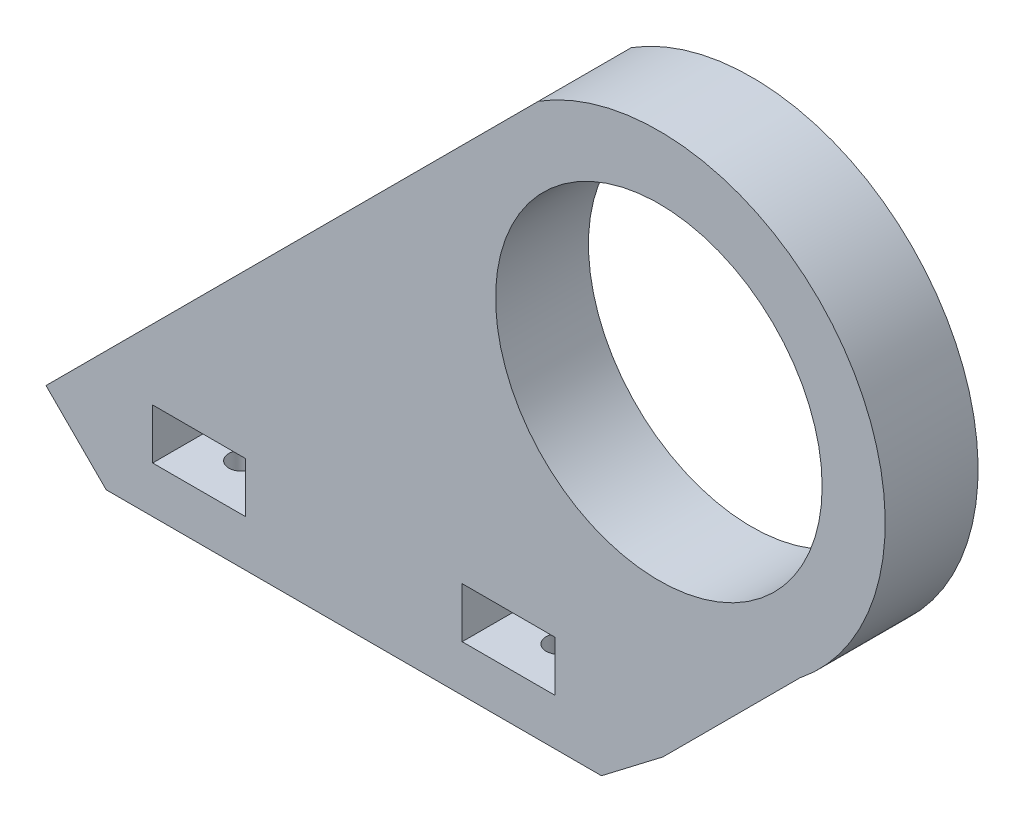
ISO-10303-21;
HEADER;
FILE_DESCRIPTION(('STEP AP214'),'2;1');
FILE_NAME('part.step','',(''),(''),'','','');
FILE_SCHEMA(('AUTOMOTIVE_DESIGN { 1 0 10303 214 1 1 1 1 }'));
ENDSEC;
DATA;
#1=APPLICATION_CONTEXT('core data for automotive mechanical design processes');
#2=APPLICATION_PROTOCOL_DEFINITION('international standard','automotive_design',2000,#1);
#3=PRODUCT_CONTEXT('',#1,'mechanical');
#4=PRODUCT('Part','Part','',(#3));
#5=PRODUCT_RELATED_PRODUCT_CATEGORY('part','',(#4));
#6=PRODUCT_DEFINITION_FORMATION('','',#4);
#7=PRODUCT_DEFINITION_CONTEXT('part definition',#1,'design');
#8=PRODUCT_DEFINITION('design','',#6,#7);
#9=PRODUCT_DEFINITION_SHAPE('','',#8);
#10=(LENGTH_UNIT() NAMED_UNIT(*) SI_UNIT(.MILLI.,.METRE.));
#11=(NAMED_UNIT(*) PLANE_ANGLE_UNIT() SI_UNIT($,.RADIAN.));
#12=(NAMED_UNIT(*) SI_UNIT($,.STERADIAN.) SOLID_ANGLE_UNIT());
#13=UNCERTAINTY_MEASURE_WITH_UNIT(LENGTH_MEASURE(1.E-05),#10,'distance_accuracy_value','');
#14=(GEOMETRIC_REPRESENTATION_CONTEXT(3) GLOBAL_UNCERTAINTY_ASSIGNED_CONTEXT((#13)) GLOBAL_UNIT_ASSIGNED_CONTEXT((#10,
#11,#12)) REPRESENTATION_CONTEXT('',''));
#15=CARTESIAN_POINT('',(0.,0.,0.));
#16=DIRECTION('',(0.,0.,1.));
#17=DIRECTION('',(1.,0.,0.));
#18=AXIS2_PLACEMENT_3D('',#15,#16,#17);
#19=CARTESIAN_POINT('',(0.,5.,-8.));
#20=DIRECTION('',(0.,0.,-1.));
#21=DIRECTION('',(-1.,0.,0.));
#22=AXIS2_PLACEMENT_3D('',#19,#20,#21);
#23=PLANE('',#22);
#24=DIRECTION('',(1.,0.,0.));
#25=VECTOR('',#24,1.);
#26=CARTESIAN_POINT('',(0.,0.,-8.));
#27=LINE('',#26,#25);
#28=CARTESIAN_POINT('',(45.,0.,-8.));
#29=VERTEX_POINT('',#28);
#30=CARTESIAN_POINT('',(64.,0.,-8.));
#31=VERTEX_POINT('',#30);
#32=EDGE_CURVE('E200',#29,#31,#27,.T.);
#33=ORIENTED_EDGE('',*,*,#32,.F.);
#34=DIRECTION('',(0.,-1.,0.));
#35=VECTOR('',#34,1.);
#36=CARTESIAN_POINT('',(45.,75.8960394725927,-8.));
#37=LINE('',#36,#35);
#38=CARTESIAN_POINT('',(45.,5.,-8.));
#39=VERTEX_POINT('',#38);
#40=EDGE_CURVE('E177',#39,#29,#37,.T.);
#41=ORIENTED_EDGE('',*,*,#40,.F.);
#42=DIRECTION('',(1.,0.,0.));
#43=VECTOR('',#42,1.);
#44=CARTESIAN_POINT('',(0.,5.,-8.));
#45=LINE('',#44,#43);
#46=CARTESIAN_POINT('',(64.,5.,-8.));
#47=VERTEX_POINT('',#46);
#48=EDGE_CURVE('E524',#39,#47,#45,.T.);
#49=ORIENTED_EDGE('',*,*,#48,.T.);
#50=DIRECTION('',(0.,-1.,0.));
#51=VECTOR('',#50,1.);
#52=CARTESIAN_POINT('',(64.,5.,-8.));
#53=LINE('',#52,#51);
#54=EDGE_CURVE('E214',#47,#31,#53,.T.);
#55=ORIENTED_EDGE('',*,*,#54,.T.);
#56=EDGE_LOOP('',(#33,#41,#49,#55));
#57=FACE_BOUND('',#56,.T.);
#58=ADVANCED_FACE('F45',(#57),#23,.T.);
#59=CARTESIAN_POINT('',(0.,5.,-8.));
#60=VERTEX_POINT('',#59);
#61=CARTESIAN_POINT('',(19.,5.,-8.));
#62=VERTEX_POINT('',#61);
#63=EDGE_CURVE('E191',#60,#62,#45,.T.);
#64=ORIENTED_EDGE('',*,*,#63,.T.);
#65=DIRECTION('',(0.,-1.,0.));
#66=VECTOR('',#65,1.);
#67=CARTESIAN_POINT('',(19.,75.8960394725927,-8.));
#68=LINE('',#67,#66);
#69=CARTESIAN_POINT('',(19.,0.,-8.));
#70=VERTEX_POINT('',#69);
#71=EDGE_CURVE('E60',#62,#70,#68,.T.);
#72=ORIENTED_EDGE('',*,*,#71,.T.);
#73=CARTESIAN_POINT('',(0.,0.,-8.));
#74=VERTEX_POINT('',#73);
#75=EDGE_CURVE('E188',#74,#70,#27,.T.);
#76=ORIENTED_EDGE('',*,*,#75,.F.);
#77=DIRECTION('',(0.,-1.,0.));
#78=VECTOR('',#77,1.);
#79=CARTESIAN_POINT('',(0.,5.,-8.));
#80=LINE('',#79,#78);
#81=EDGE_CURVE('E218',#60,#74,#80,.T.);
#82=ORIENTED_EDGE('',*,*,#81,.F.);
#83=EDGE_LOOP('',(#64,#72,#76,#82));
#84=FACE_BOUND('',#83,.T.);
#85=ADVANCED_FACE('F187',(#84),#23,.T.);
#86=CARTESIAN_POINT('',(71.414976798119,46.6472104895444,0.));
#87=DIRECTION('',(0.,0.,1.));
#88=DIRECTION('',(1.,0.,0.));
#89=AXIS2_PLACEMENT_3D('',#86,#87,#88);
#90=PLANE('',#89);
#91=CARTESIAN_POINT('',(71.414976798119,46.6472104895444,0.));
#92=DIRECTION('',(0.,0.,1.));
#93=DIRECTION('',(1.,0.,0.));
#94=AXIS2_PLACEMENT_3D('',#91,#92,#93);
#95=CIRCLE('',#94,21.1);
#96=CARTESIAN_POINT('',(92.514976798119,46.6472104895444,0.));
#97=VERTEX_POINT('',#96);
#98=EDGE_CURVE('E539',#97,#97,#95,.T.);
#99=ORIENTED_EDGE('',*,*,#98,.T.);
#100=EDGE_LOOP('',(#99));
#101=FACE_BOUND('',#100,.T.);
#102=DIRECTION('',(0.,-1.,0.));
#103=VECTOR('',#102,1.);
#104=CARTESIAN_POINT('',(46.,12.5,0.));
#105=LINE('',#104,#103);
#106=CARTESIAN_POINT('',(46.,12.5,0.));
#107=VERTEX_POINT('',#106);
#108=CARTESIAN_POINT('',(46.,6.,0.));
#109=VERTEX_POINT('',#108);
#110=EDGE_CURVE('E274',#107,#109,#105,.T.);
#111=ORIENTED_EDGE('',*,*,#110,.T.);
#112=DIRECTION('',(1.,0.,0.));
#113=VECTOR('',#112,1.);
#114=CARTESIAN_POINT('',(58.,6.,0.));
#115=LINE('',#114,#113);
#116=CARTESIAN_POINT('',(58.,6.,0.));
#117=VERTEX_POINT('',#116);
#118=EDGE_CURVE('E288',#109,#117,#115,.T.);
#119=ORIENTED_EDGE('',*,*,#118,.T.);
#120=DIRECTION('',(0.,1.,0.));
#121=VECTOR('',#120,1.);
#122=CARTESIAN_POINT('',(58.,12.5,0.));
#123=LINE('',#122,#121);
#124=CARTESIAN_POINT('',(58.,12.5,0.));
#125=VERTEX_POINT('',#124);
#126=EDGE_CURVE('E305',#117,#125,#123,.T.);
#127=ORIENTED_EDGE('',*,*,#126,.T.);
#128=DIRECTION('',(-1.,0.,0.));
#129=VECTOR('',#128,1.);
#130=CARTESIAN_POINT('',(58.,12.5,0.));
#131=LINE('',#130,#129);
#132=EDGE_CURVE('E301',#125,#107,#131,.T.);
#133=ORIENTED_EDGE('',*,*,#132,.T.);
#134=EDGE_LOOP('',(#111,#119,#127,#133));
#135=FACE_BOUND('',#134,.T.);
#136=DIRECTION('',(-1.,0.,0.));
#137=VECTOR('',#136,1.);
#138=CARTESIAN_POINT('',(18.,12.5,0.));
#139=LINE('',#138,#137);
#140=CARTESIAN_POINT('',(18.,12.5,0.));
#141=VERTEX_POINT('',#140);
#142=CARTESIAN_POINT('',(6.,12.5,0.));
#143=VERTEX_POINT('',#142);
#144=EDGE_CURVE('E239',#141,#143,#139,.T.);
#145=ORIENTED_EDGE('',*,*,#144,.T.);
#146=DIRECTION('',(0.,-1.,0.));
#147=VECTOR('',#146,1.);
#148=CARTESIAN_POINT('',(6.,12.5,0.));
#149=LINE('',#148,#147);
#150=CARTESIAN_POINT('',(6.,6.,0.));
#151=VERTEX_POINT('',#150);
#152=EDGE_CURVE('E226',#143,#151,#149,.T.);
#153=ORIENTED_EDGE('',*,*,#152,.T.);
#154=DIRECTION('',(1.,0.,0.));
#155=VECTOR('',#154,1.);
#156=CARTESIAN_POINT('',(18.,6.,0.));
#157=LINE('',#156,#155);
#158=CARTESIAN_POINT('',(18.,6.,0.));
#159=VERTEX_POINT('',#158);
#160=EDGE_CURVE('E230',#151,#159,#157,.T.);
#161=ORIENTED_EDGE('',*,*,#160,.T.);
#162=DIRECTION('',(0.,1.,0.));
#163=VECTOR('',#162,1.);
#164=CARTESIAN_POINT('',(18.,12.5,0.));
#165=LINE('',#164,#163);
#166=EDGE_CURVE('E235',#159,#141,#165,.T.);
#167=ORIENTED_EDGE('',*,*,#166,.T.);
#168=EDGE_LOOP('',(#145,#153,#161,#167));
#169=FACE_BOUND('',#168,.T.);
#170=DIRECTION('',(0.,-1.,0.));
#171=VECTOR('',#170,1.);
#172=CARTESIAN_POINT('',(64.,5.,0.));
#173=LINE('',#172,#171);
#174=CARTESIAN_POINT('',(64.,5.,0.));
#175=VERTEX_POINT('',#174);
#176=CARTESIAN_POINT('',(64.,0.,0.));
#177=VERTEX_POINT('',#176);
#178=EDGE_CURVE('E210',#175,#177,#173,.T.);
#179=ORIENTED_EDGE('',*,*,#178,.F.);
#180=DIRECTION('',(-1.,0.,0.));
#181=VECTOR('',#180,1.);
#182=CARTESIAN_POINT('',(64.,5.,0.));
#183=LINE('',#182,#181);
#184=CARTESIAN_POINT('',(0.,5.,0.));
#185=VERTEX_POINT('',#184);
#186=EDGE_CURVE('E205',#175,#185,#183,.T.);
#187=ORIENTED_EDGE('',*,*,#186,.T.);
#188=DIRECTION('',(0.,-1.,0.));
#189=VECTOR('',#188,1.);
#190=CARTESIAN_POINT('',(0.,5.,0.));
#191=LINE('',#190,#189);
#192=CARTESIAN_POINT('',(0.,0.,0.));
#193=VERTEX_POINT('',#192);
#194=EDGE_CURVE('E221',#185,#193,#191,.T.);
#195=ORIENTED_EDGE('',*,*,#194,.T.);
#196=DIRECTION('',(0.707106781186548,-0.707106781186548,0.));
#197=VECTOR('',#196,1.);
#198=CARTESIAN_POINT('',(0.,0.,0.));
#199=LINE('',#198,#197);
#200=CARTESIAN_POINT('',(-7.77817459305202,7.77817459305202,0.));
#201=VERTEX_POINT('',#200);
#202=EDGE_CURVE('E321',#201,#193,#199,.T.);
#203=ORIENTED_EDGE('',*,*,#202,.F.);
#204=DIRECTION('',(-0.707106781186547,-0.707106781186547,0.));
#205=VECTOR('',#204,1.);
#206=CARTESIAN_POINT('',(-7.77817459305202,7.77817459305202,0.));
#207=LINE('',#206,#205);
#208=CARTESIAN_POINT('',(55.8614357137373,71.4177848998413,0.));
#209=VERTEX_POINT('',#208);
#210=EDGE_CURVE('E333',#209,#201,#207,.T.);
#211=ORIENTED_EDGE('',*,*,#210,.F.);
#212=CARTESIAN_POINT('',(71.414976798119,46.6472104895444,0.));
#213=DIRECTION('',(0.,0.,1.));
#214=DIRECTION('',(1.,0.,0.));
#215=AXIS2_PLACEMENT_3D('',#212,#213,#214);
#216=CIRCLE('',#215,29.2488289830483);
#217=CARTESIAN_POINT('',(89.619615376901,23.7543047959562,0.));
#218=VERTEX_POINT('',#217);
#219=EDGE_CURVE('E358',#218,#209,#216,.T.);
#220=ORIENTED_EDGE('',*,*,#219,.F.);
#221=DIRECTION('',(0.707106781186547,0.707106781186548,0.));
#222=VECTOR('',#221,1.);
#223=CARTESIAN_POINT('',(71.9419458472373,6.07663526629248,0.));
#224=LINE('',#223,#222);
#225=CARTESIAN_POINT('',(71.9419458472373,6.07663526629248,0.));
#226=VERTEX_POINT('',#225);
#227=EDGE_CURVE('E355',#226,#218,#224,.T.);
#228=ORIENTED_EDGE('',*,*,#227,.F.);
#229=DIRECTION('',(0.794194584723734,0.607663526629248,0.));
#230=VECTOR('',#229,1.);
#231=CARTESIAN_POINT('',(64.,0.,0.));
#232=LINE('',#231,#230);
#233=EDGE_CURVE('E352',#177,#226,#232,.T.);
#234=ORIENTED_EDGE('',*,*,#233,.F.);
#235=EDGE_LOOP('',(#179,#187,#195,#203,#211,#220,#228,#234));
#236=FACE_BOUND('',#235,.T.);
#237=ADVANCED_FACE('F419',(#101,#135,#169,#236),#90,.F.);
#238=CARTESIAN_POINT('',(0.,0.,12.));
#239=DIRECTION('',(0.707106781186547,0.707106781186547,0.));
#240=DIRECTION('',(-0.707106781186548,0.707106781186548,0.));
#241=AXIS2_PLACEMENT_3D('',#238,#239,#240);
#242=PLANE('',#241);
#243=ORIENTED_EDGE('',*,*,#202,.T.);
#244=DIRECTION('',(0.,0.,-1.));
#245=VECTOR('',#244,1.);
#246=CARTESIAN_POINT('',(0.,0.,12.));
#247=LINE('',#246,#245);
#248=CARTESIAN_POINT('',(0.,0.,12.));
#249=VERTEX_POINT('',#248);
#250=EDGE_CURVE('E54',#249,#193,#247,.T.);
#251=ORIENTED_EDGE('',*,*,#250,.F.);
#252=DIRECTION('',(0.707106781186548,-0.707106781186548,0.));
#253=VECTOR('',#252,1.);
#254=CARTESIAN_POINT('',(0.,0.,12.));
#255=LINE('',#254,#253);
#256=CARTESIAN_POINT('',(-7.77817459305202,7.77817459305202,12.));
#257=VERTEX_POINT('',#256);
#258=EDGE_CURVE('E328',#257,#249,#255,.T.);
#259=ORIENTED_EDGE('',*,*,#258,.F.);
#260=DIRECTION('',(0.,0.,-1.));
#261=VECTOR('',#260,1.);
#262=CARTESIAN_POINT('',(-7.77817459305202,7.77817459305202,12.));
#263=LINE('',#262,#261);
#264=EDGE_CURVE('E348',#257,#201,#263,.T.);
#265=ORIENTED_EDGE('',*,*,#264,.T.);
#266=EDGE_LOOP('',(#243,#251,#259,#265));
#267=FACE_BOUND('',#266,.T.);
#268=ADVANCED_FACE('F47',(#267),#242,.F.);
#269=CARTESIAN_POINT('',(0.,0.,12.));
#270=DIRECTION('',(0.,1.,0.));
#271=DIRECTION('',(0.,0.,1.));
#272=AXIS2_PLACEMENT_3D('',#269,#270,#271);
#273=PLANE('',#272);
#274=CARTESIAN_POINT('',(32.,0.,-21.));
#275=DIRECTION('',(0.,1.,0.));
#276=DIRECTION('',(0.,0.,1.));
#277=AXIS2_PLACEMENT_3D('',#274,#275,#276);
#278=CIRCLE('',#277,18.3847763108503);
#279=EDGE_CURVE('E174',#29,#70,#278,.F.);
#280=ORIENTED_EDGE('',*,*,#279,.F.);
#281=ORIENTED_EDGE('',*,*,#32,.T.);
#282=DIRECTION('',(0.,0.,1.));
#283=VECTOR('',#282,1.);
#284=CARTESIAN_POINT('',(64.,0.,-8.));
#285=LINE('',#284,#283);
#286=EDGE_CURVE('E199',#31,#177,#285,.T.);
#287=ORIENTED_EDGE('',*,*,#286,.T.);
#288=DIRECTION('',(0.,0.,-1.));
#289=VECTOR('',#288,1.);
#290=CARTESIAN_POINT('',(64.,0.,12.));
#291=LINE('',#290,#289);
#292=CARTESIAN_POINT('',(64.,0.,12.));
#293=VERTEX_POINT('',#292);
#294=EDGE_CURVE('E378',#293,#177,#291,.T.);
#295=ORIENTED_EDGE('',*,*,#294,.F.);
#296=DIRECTION('',(1.,0.,0.));
#297=VECTOR('',#296,1.);
#298=CARTESIAN_POINT('',(0.,0.,12.));
#299=LINE('',#298,#297);
#300=EDGE_CURVE('E332',#249,#293,#299,.T.);
#301=ORIENTED_EDGE('',*,*,#300,.F.);
#302=ORIENTED_EDGE('',*,*,#250,.T.);
#303=DIRECTION('',(0.,0.,-1.));
#304=VECTOR('',#303,1.);
#305=CARTESIAN_POINT('',(0.,0.,0.));
#306=LINE('',#305,#304);
#307=EDGE_CURVE('E197',#193,#74,#306,.T.);
#308=ORIENTED_EDGE('',*,*,#307,.T.);
#309=ORIENTED_EDGE('',*,*,#75,.T.);
#310=EDGE_LOOP('',(#280,#281,#287,#295,#301,#302,#308,#309));
#311=FACE_BOUND('',#310,.T.);
#312=CARTESIAN_POINT('',(11.5,0.,-4.));
#313=DIRECTION('',(0.,-1.,0.));
#314=DIRECTION('',(0.,0.,-1.));
#315=AXIS2_PLACEMENT_3D('',#312,#313,#314);
#316=CIRCLE('',#315,1.65);
#317=CARTESIAN_POINT('',(11.5,0.,-5.65));
#318=VERTEX_POINT('',#317);
#319=EDGE_CURVE('E388',#318,#318,#316,.T.);
#320=ORIENTED_EDGE('',*,*,#319,.F.);
#321=EDGE_LOOP('',(#320));
#322=FACE_BOUND('',#321,.T.);
#323=CARTESIAN_POINT('',(52.5,0.,-4.));
#324=DIRECTION('',(0.,-1.,0.));
#325=DIRECTION('',(0.,0.,-1.));
#326=AXIS2_PLACEMENT_3D('',#323,#324,#325);
#327=CIRCLE('',#326,1.65);
#328=CARTESIAN_POINT('',(52.5,0.,-5.65));
#329=VERTEX_POINT('',#328);
#330=EDGE_CURVE('E535',#329,#329,#327,.T.);
#331=ORIENTED_EDGE('',*,*,#330,.F.);
#332=EDGE_LOOP('',(#331));
#333=FACE_BOUND('',#332,.T.);
#334=CARTESIAN_POINT('',(11.5,0.,6.));
#335=DIRECTION('',(0.,-1.,0.));
#336=DIRECTION('',(0.,0.,-1.));
#337=AXIS2_PLACEMENT_3D('',#334,#335,#336);
#338=CIRCLE('',#337,1.65);
#339=CARTESIAN_POINT('',(11.5,0.,4.35));
#340=VERTEX_POINT('',#339);
#341=EDGE_CURVE('E317',#340,#340,#338,.T.);
#342=ORIENTED_EDGE('',*,*,#341,.F.);
#343=EDGE_LOOP('',(#342));
#344=FACE_BOUND('',#343,.T.);
#345=CARTESIAN_POINT('',(52.5,0.,6.));
#346=DIRECTION('',(0.,-1.,0.));
#347=DIRECTION('',(0.,0.,-1.));
#348=AXIS2_PLACEMENT_3D('',#345,#346,#347);
#349=CIRCLE('',#348,1.65);
#350=CARTESIAN_POINT('',(52.5,0.,4.35));
#351=VERTEX_POINT('',#350);
#352=EDGE_CURVE('E316',#351,#351,#349,.T.);
#353=ORIENTED_EDGE('',*,*,#352,.F.);
#354=EDGE_LOOP('',(#353));
#355=FACE_BOUND('',#354,.T.);
#356=ADVANCED_FACE('F194',(#311,#322,#333,#344,#355),#273,.F.);
#357=CARTESIAN_POINT('',(64.,0.,12.));
#358=DIRECTION('',(-0.607663526629248,0.794194584723734,0.));
#359=DIRECTION('',(-0.794194584723734,-0.607663526629248,0.));
#360=AXIS2_PLACEMENT_3D('',#357,#358,#359);
#361=PLANE('',#360);
#362=ORIENTED_EDGE('',*,*,#233,.T.);
#363=DIRECTION('',(0.,0.,-1.));
#364=VECTOR('',#363,1.);
#365=CARTESIAN_POINT('',(71.9419458472373,6.07663526629248,12.));
#366=LINE('',#365,#364);
#367=CARTESIAN_POINT('',(71.9419458472373,6.07663526629248,12.));
#368=VERTEX_POINT('',#367);
#369=EDGE_CURVE('E374',#368,#226,#366,.T.);
#370=ORIENTED_EDGE('',*,*,#369,.F.);
#371=DIRECTION('',(0.794194584723734,0.607663526629248,0.));
#372=VECTOR('',#371,1.);
#373=CARTESIAN_POINT('',(64.,0.,12.));
#374=LINE('',#373,#372);
#375=EDGE_CURVE('E336',#293,#368,#374,.T.);
#376=ORIENTED_EDGE('',*,*,#375,.F.);
#377=ORIENTED_EDGE('',*,*,#294,.T.);
#378=EDGE_LOOP('',(#362,#370,#376,#377));
#379=FACE_BOUND('',#378,.T.);
#380=ADVANCED_FACE('F484',(#379),#361,.F.);
#381=CARTESIAN_POINT('',(71.9419458472373,6.07663526629248,12.));
#382=DIRECTION('',(-0.707106781186548,0.707106781186547,0.));
#383=DIRECTION('',(-0.707106781186547,-0.707106781186548,0.));
#384=AXIS2_PLACEMENT_3D('',#381,#382,#383);
#385=PLANE('',#384);
#386=ORIENTED_EDGE('',*,*,#227,.T.);
#387=DIRECTION('',(0.,0.,-1.));
#388=VECTOR('',#387,1.);
#389=CARTESIAN_POINT('',(89.619615376901,23.7543047959562,12.));
#390=LINE('',#389,#388);
#391=CARTESIAN_POINT('',(89.619615376901,23.7543047959562,12.));
#392=VERTEX_POINT('',#391);
#393=EDGE_CURVE('E370',#392,#218,#390,.T.);
#394=ORIENTED_EDGE('',*,*,#393,.F.);
#395=DIRECTION('',(0.707106781186547,0.707106781186548,0.));
#396=VECTOR('',#395,1.);
#397=CARTESIAN_POINT('',(71.9419458472373,6.07663526629248,12.));
#398=LINE('',#397,#396);
#399=EDGE_CURVE('E339',#368,#392,#398,.T.);
#400=ORIENTED_EDGE('',*,*,#399,.F.);
#401=ORIENTED_EDGE('',*,*,#369,.T.);
#402=EDGE_LOOP('',(#386,#394,#400,#401));
#403=FACE_BOUND('',#402,.T.);
#404=ADVANCED_FACE('F480',(#403),#385,.F.);
#405=CARTESIAN_POINT('',(71.414976798119,46.6472104895444,12.));
#406=DIRECTION('',(0.,0.,-1.));
#407=DIRECTION('',(-1.,0.,0.));
#408=AXIS2_PLACEMENT_3D('',#405,#406,#407);
#409=CYLINDRICAL_SURFACE('',#408,29.2488289830483);
#410=ORIENTED_EDGE('',*,*,#219,.T.);
#411=DIRECTION('',(0.,0.,-1.));
#412=VECTOR('',#411,1.);
#413=CARTESIAN_POINT('',(55.8614357137373,71.4177848998413,12.));
#414=LINE('',#413,#412);
#415=CARTESIAN_POINT('',(55.8614357137373,71.4177848998413,12.));
#416=VERTEX_POINT('',#415);
#417=EDGE_CURVE('E366',#416,#209,#414,.T.);
#418=ORIENTED_EDGE('',*,*,#417,.F.);
#419=CARTESIAN_POINT('',(71.414976798119,46.6472104895444,12.));
#420=DIRECTION('',(0.,0.,1.));
#421=DIRECTION('',(1.,0.,0.));
#422=AXIS2_PLACEMENT_3D('',#419,#420,#421);
#423=CIRCLE('',#422,29.2488289830483);
#424=EDGE_CURVE('E342',#392,#416,#423,.T.);
#425=ORIENTED_EDGE('',*,*,#424,.F.);
#426=ORIENTED_EDGE('',*,*,#393,.T.);
#427=EDGE_LOOP('',(#410,#418,#425,#426));
#428=FACE_BOUND('',#427,.T.);
#429=ADVANCED_FACE('F476',(#428),#409,.T.);
#430=CARTESIAN_POINT('',(-7.77817459305202,7.77817459305202,12.));
#431=DIRECTION('',(0.707106781186548,-0.707106781186548,0.));
#432=DIRECTION('',(0.707106781186548,0.707106781186548,0.));
#433=AXIS2_PLACEMENT_3D('',#430,#431,#432);
#434=PLANE('',#433);
#435=ORIENTED_EDGE('',*,*,#210,.T.);
#436=ORIENTED_EDGE('',*,*,#264,.F.);
#437=DIRECTION('',(-0.707106781186547,-0.707106781186547,0.));
#438=VECTOR('',#437,1.);
#439=CARTESIAN_POINT('',(-7.77817459305202,7.77817459305202,12.));
#440=LINE('',#439,#438);
#441=EDGE_CURVE('E345',#416,#257,#440,.T.);
#442=ORIENTED_EDGE('',*,*,#441,.F.);
#443=ORIENTED_EDGE('',*,*,#417,.T.);
#444=EDGE_LOOP('',(#435,#436,#442,#443));
#445=FACE_BOUND('',#444,.T.);
#446=ADVANCED_FACE('F470',(#445),#434,.F.);
#447=CARTESIAN_POINT('',(71.414976798119,46.6472104895444,12.));
#448=DIRECTION('',(0.,0.,1.));
#449=DIRECTION('',(1.,0.,0.));
#450=AXIS2_PLACEMENT_3D('',#447,#448,#449);
#451=PLANE('',#450);
#452=CARTESIAN_POINT('',(71.414976798119,46.6472104895444,12.));
#453=DIRECTION('',(0.,0.,1.));
#454=DIRECTION('',(1.,0.,0.));
#455=AXIS2_PLACEMENT_3D('',#452,#453,#454);
#456=CIRCLE('',#455,21.1);
#457=CARTESIAN_POINT('',(92.514976798119,46.6472104895444,12.));
#458=VERTEX_POINT('',#457);
#459=EDGE_CURVE('E182',#458,#458,#456,.T.);
#460=ORIENTED_EDGE('',*,*,#459,.F.);
#461=EDGE_LOOP('',(#460));
#462=FACE_BOUND('',#461,.T.);
#463=DIRECTION('',(0.,-1.,0.));
#464=VECTOR('',#463,1.);
#465=CARTESIAN_POINT('',(6.,12.5,12.));
#466=LINE('',#465,#464);
#467=CARTESIAN_POINT('',(6.,12.5,12.));
#468=VERTEX_POINT('',#467);
#469=CARTESIAN_POINT('',(6.00000000000001,6.,12.));
#470=VERTEX_POINT('',#469);
#471=EDGE_CURVE('E68',#468,#470,#466,.T.);
#472=ORIENTED_EDGE('',*,*,#471,.F.);
#473=DIRECTION('',(-1.,0.,0.));
#474=VECTOR('',#473,1.);
#475=CARTESIAN_POINT('',(18.,12.5,12.));
#476=LINE('',#475,#474);
#477=CARTESIAN_POINT('',(18.,12.5,12.));
#478=VERTEX_POINT('',#477);
#479=EDGE_CURVE('E231',#478,#468,#476,.T.);
#480=ORIENTED_EDGE('',*,*,#479,.F.);
#481=DIRECTION('',(0.,1.,0.));
#482=VECTOR('',#481,1.);
#483=CARTESIAN_POINT('',(18.,12.5,12.));
#484=LINE('',#483,#482);
#485=CARTESIAN_POINT('',(18.,6.,12.));
#486=VERTEX_POINT('',#485);
#487=EDGE_CURVE('E251',#486,#478,#484,.T.);
#488=ORIENTED_EDGE('',*,*,#487,.F.);
#489=DIRECTION('',(1.,0.,0.));
#490=VECTOR('',#489,1.);
#491=CARTESIAN_POINT('',(18.,6.,12.));
#492=LINE('',#491,#490);
#493=EDGE_CURVE('E246',#470,#486,#492,.T.);
#494=ORIENTED_EDGE('',*,*,#493,.F.);
#495=EDGE_LOOP('',(#472,#480,#488,#494));
#496=FACE_BOUND('',#495,.T.);
#497=DIRECTION('',(1.,0.,0.));
#498=VECTOR('',#497,1.);
#499=CARTESIAN_POINT('',(58.,6.,12.));
#500=LINE('',#499,#498);
#501=CARTESIAN_POINT('',(46.,6.,12.));
#502=VERTEX_POINT('',#501);
#503=CARTESIAN_POINT('',(58.,6.00000000000001,12.));
#504=VERTEX_POINT('',#503);
#505=EDGE_CURVE('E247',#502,#504,#500,.T.);
#506=ORIENTED_EDGE('',*,*,#505,.F.);
#507=DIRECTION('',(0.,-1.,0.));
#508=VECTOR('',#507,1.);
#509=CARTESIAN_POINT('',(46.,12.5,12.));
#510=LINE('',#509,#508);
#511=CARTESIAN_POINT('',(46.,12.5,12.));
#512=VERTEX_POINT('',#511);
#513=EDGE_CURVE('E283',#512,#502,#510,.T.);
#514=ORIENTED_EDGE('',*,*,#513,.F.);
#515=DIRECTION('',(-1.,0.,0.));
#516=VECTOR('',#515,1.);
#517=CARTESIAN_POINT('',(58.,12.5,12.));
#518=LINE('',#517,#516);
#519=CARTESIAN_POINT('',(58.,12.5,12.));
#520=VERTEX_POINT('',#519);
#521=EDGE_CURVE('E287',#520,#512,#518,.T.);
#522=ORIENTED_EDGE('',*,*,#521,.F.);
#523=DIRECTION('',(0.,1.,0.));
#524=VECTOR('',#523,1.);
#525=CARTESIAN_POINT('',(58.,12.5,12.));
#526=LINE('',#525,#524);
#527=EDGE_CURVE('E292',#504,#520,#526,.T.);
#528=ORIENTED_EDGE('',*,*,#527,.F.);
#529=EDGE_LOOP('',(#506,#514,#522,#528));
#530=FACE_BOUND('',#529,.T.);
#531=ORIENTED_EDGE('',*,*,#258,.T.);
#532=ORIENTED_EDGE('',*,*,#300,.T.);
#533=ORIENTED_EDGE('',*,*,#375,.T.);
#534=ORIENTED_EDGE('',*,*,#399,.T.);
#535=ORIENTED_EDGE('',*,*,#424,.T.);
#536=ORIENTED_EDGE('',*,*,#441,.T.);
#537=EDGE_LOOP('',(#531,#532,#533,#534,#535,#536));
#538=FACE_BOUND('',#537,.T.);
#539=ADVANCED_FACE('F466',(#462,#496,#530,#538),#451,.T.);
#540=CARTESIAN_POINT('',(52.5,6.,6.));
#541=DIRECTION('',(0.,-1.,0.));
#542=DIRECTION('',(0.,0.,-1.));
#543=AXIS2_PLACEMENT_3D('',#540,#541,#542);
#544=CYLINDRICAL_SURFACE('',#543,1.65);
#545=CARTESIAN_POINT('',(52.5,6.,6.));
#546=DIRECTION('',(0.,-1.,0.));
#547=DIRECTION('',(0.,0.,-1.));
#548=AXIS2_PLACEMENT_3D('',#545,#546,#547);
#549=CIRCLE('',#548,1.65);
#550=CARTESIAN_POINT('',(52.5,6.,4.35));
#551=VERTEX_POINT('',#550);
#552=EDGE_CURVE('E261',#551,#551,#549,.T.);
#553=ORIENTED_EDGE('',*,*,#552,.F.);
#554=EDGE_LOOP('',(#553));
#555=FACE_BOUND('',#554,.T.);
#556=ORIENTED_EDGE('',*,*,#352,.T.);
#557=EDGE_LOOP('',(#556));
#558=FACE_BOUND('',#557,.T.);
#559=ADVANCED_FACE('F462',(#555,#558),#544,.F.);
#560=CARTESIAN_POINT('',(11.5,6.,6.));
#561=DIRECTION('',(0.,-1.,0.));
#562=DIRECTION('',(0.,0.,-1.));
#563=AXIS2_PLACEMENT_3D('',#560,#561,#562);
#564=CYLINDRICAL_SURFACE('',#563,1.65);
#565=CARTESIAN_POINT('',(11.5,6.,6.));
#566=DIRECTION('',(0.,-1.,0.));
#567=DIRECTION('',(0.,0.,-1.));
#568=AXIS2_PLACEMENT_3D('',#565,#566,#567);
#569=CIRCLE('',#568,1.65);
#570=CARTESIAN_POINT('',(11.5,6.,4.35));
#571=VERTEX_POINT('',#570);
#572=EDGE_CURVE('E312',#571,#571,#569,.T.);
#573=ORIENTED_EDGE('',*,*,#572,.F.);
#574=EDGE_LOOP('',(#573));
#575=FACE_BOUND('',#574,.T.);
#576=ORIENTED_EDGE('',*,*,#341,.T.);
#577=EDGE_LOOP('',(#576));
#578=FACE_BOUND('',#577,.T.);
#579=ADVANCED_FACE('F448',(#575,#578),#564,.F.);
#580=CARTESIAN_POINT('',(58.,6.,0.));
#581=DIRECTION('',(0.,-1.,0.));
#582=DIRECTION('',(0.,0.,-1.));
#583=AXIS2_PLACEMENT_3D('',#580,#581,#582);
#584=PLANE('',#583);
#585=ORIENTED_EDGE('',*,*,#552,.T.);
#586=EDGE_LOOP('',(#585));
#587=FACE_BOUND('',#586,.T.);
#588=ORIENTED_EDGE('',*,*,#505,.T.);
#589=DIRECTION('',(0.,0.,1.));
#590=VECTOR('',#589,1.);
#591=CARTESIAN_POINT('',(58.,6.,0.));
#592=LINE('',#591,#590);
#593=EDGE_CURVE('E270',#117,#504,#592,.T.);
#594=ORIENTED_EDGE('',*,*,#593,.F.);
#595=ORIENTED_EDGE('',*,*,#118,.F.);
#596=DIRECTION('',(0.,0.,1.));
#597=VECTOR('',#596,1.);
#598=CARTESIAN_POINT('',(46.,6.,0.));
#599=LINE('',#598,#597);
#600=EDGE_CURVE('E213',#109,#502,#599,.T.);
#601=ORIENTED_EDGE('',*,*,#600,.T.);
#602=EDGE_LOOP('',(#588,#594,#595,#601));
#603=FACE_BOUND('',#602,.T.);
#604=ADVANCED_FACE('F444',(#587,#603),#584,.F.);
#605=CARTESIAN_POINT('',(46.,12.5,0.));
#606=DIRECTION('',(-1.,0.,0.));
#607=DIRECTION('',(0.,-1.,0.));
#608=AXIS2_PLACEMENT_3D('',#605,#606,#607);
#609=PLANE('',#608);
#610=ORIENTED_EDGE('',*,*,#513,.T.);
#611=ORIENTED_EDGE('',*,*,#600,.F.);
#612=ORIENTED_EDGE('',*,*,#110,.F.);
#613=DIRECTION('',(0.,0.,1.));
#614=VECTOR('',#613,1.);
#615=CARTESIAN_POINT('',(46.,12.5,0.));
#616=LINE('',#615,#614);
#617=EDGE_CURVE('E278',#107,#512,#616,.T.);
#618=ORIENTED_EDGE('',*,*,#617,.T.);
#619=EDGE_LOOP('',(#610,#611,#612,#618));
#620=FACE_BOUND('',#619,.T.);
#621=ADVANCED_FACE('F447',(#620),#609,.F.);
#622=CARTESIAN_POINT('',(58.,12.5,0.));
#623=DIRECTION('',(0.,1.,0.));
#624=DIRECTION('',(0.,0.,1.));
#625=AXIS2_PLACEMENT_3D('',#622,#623,#624);
#626=PLANE('',#625);
#627=ORIENTED_EDGE('',*,*,#521,.T.);
#628=ORIENTED_EDGE('',*,*,#617,.F.);
#629=ORIENTED_EDGE('',*,*,#132,.F.);
#630=DIRECTION('',(0.,0.,1.));
#631=VECTOR('',#630,1.);
#632=CARTESIAN_POINT('',(58.,12.5,0.));
#633=LINE('',#632,#631);
#634=EDGE_CURVE('E275',#125,#520,#633,.T.);
#635=ORIENTED_EDGE('',*,*,#634,.T.);
#636=EDGE_LOOP('',(#627,#628,#629,#635));
#637=FACE_BOUND('',#636,.T.);
#638=ADVANCED_FACE('F452',(#637),#626,.F.);
#639=CARTESIAN_POINT('',(58.,12.5,0.));
#640=DIRECTION('',(1.,0.,0.));
#641=DIRECTION('',(0.,0.,-1.));
#642=AXIS2_PLACEMENT_3D('',#639,#640,#641);
#643=PLANE('',#642);
#644=ORIENTED_EDGE('',*,*,#527,.T.);
#645=ORIENTED_EDGE('',*,*,#634,.F.);
#646=ORIENTED_EDGE('',*,*,#126,.F.);
#647=ORIENTED_EDGE('',*,*,#593,.T.);
#648=EDGE_LOOP('',(#644,#645,#646,#647));
#649=FACE_BOUND('',#648,.T.);
#650=ADVANCED_FACE('F443',(#649),#643,.F.);
#651=CARTESIAN_POINT('',(6.,12.5,0.));
#652=DIRECTION('',(-1.,0.,0.));
#653=DIRECTION('',(0.,0.,1.));
#654=AXIS2_PLACEMENT_3D('',#651,#652,#653);
#655=PLANE('',#654);
#656=ORIENTED_EDGE('',*,*,#471,.T.);
#657=DIRECTION('',(0.,0.,1.));
#658=VECTOR('',#657,1.);
#659=CARTESIAN_POINT('',(6.,6.,0.));
#660=LINE('',#659,#658);
#661=EDGE_CURVE('E243',#151,#470,#660,.T.);
#662=ORIENTED_EDGE('',*,*,#661,.F.);
#663=ORIENTED_EDGE('',*,*,#152,.F.);
#664=DIRECTION('',(0.,0.,1.));
#665=VECTOR('',#664,1.);
#666=CARTESIAN_POINT('',(6.,12.5,0.));
#667=LINE('',#666,#665);
#668=EDGE_CURVE('E258',#143,#468,#667,.T.);
#669=ORIENTED_EDGE('',*,*,#668,.T.);
#670=EDGE_LOOP('',(#656,#662,#663,#669));
#671=FACE_BOUND('',#670,.T.);
#672=ADVANCED_FACE('F432',(#671),#655,.F.);
#673=CARTESIAN_POINT('',(18.,12.5,0.));
#674=DIRECTION('',(0.,1.,0.));
#675=DIRECTION('',(0.,0.,1.));
#676=AXIS2_PLACEMENT_3D('',#673,#674,#675);
#677=PLANE('',#676);
#678=ORIENTED_EDGE('',*,*,#479,.T.);
#679=ORIENTED_EDGE('',*,*,#668,.F.);
#680=ORIENTED_EDGE('',*,*,#144,.F.);
#681=DIRECTION('',(0.,0.,1.));
#682=VECTOR('',#681,1.);
#683=CARTESIAN_POINT('',(18.,12.5,0.));
#684=LINE('',#683,#682);
#685=EDGE_CURVE('E262',#141,#478,#684,.T.);
#686=ORIENTED_EDGE('',*,*,#685,.T.);
#687=EDGE_LOOP('',(#678,#679,#680,#686));
#688=FACE_BOUND('',#687,.T.);
#689=ADVANCED_FACE('F428',(#688),#677,.F.);
#690=CARTESIAN_POINT('',(18.,12.5,0.));
#691=DIRECTION('',(1.,0.,0.));
#692=DIRECTION('',(0.,0.,-1.));
#693=AXIS2_PLACEMENT_3D('',#690,#691,#692);
#694=PLANE('',#693);
#695=ORIENTED_EDGE('',*,*,#487,.T.);
#696=ORIENTED_EDGE('',*,*,#685,.F.);
#697=ORIENTED_EDGE('',*,*,#166,.F.);
#698=DIRECTION('',(0.,0.,1.));
#699=VECTOR('',#698,1.);
#700=CARTESIAN_POINT('',(18.,6.,0.));
#701=LINE('',#700,#699);
#702=EDGE_CURVE('E265',#159,#486,#701,.T.);
#703=ORIENTED_EDGE('',*,*,#702,.T.);
#704=EDGE_LOOP('',(#695,#696,#697,#703));
#705=FACE_BOUND('',#704,.T.);
#706=ADVANCED_FACE('F431',(#705),#694,.F.);
#707=CARTESIAN_POINT('',(18.,6.,0.));
#708=DIRECTION('',(0.,-1.,0.));
#709=DIRECTION('',(0.,0.,-1.));
#710=AXIS2_PLACEMENT_3D('',#707,#708,#709);
#711=PLANE('',#710);
#712=ORIENTED_EDGE('',*,*,#572,.T.);
#713=EDGE_LOOP('',(#712));
#714=FACE_BOUND('',#713,.T.);
#715=ORIENTED_EDGE('',*,*,#493,.T.);
#716=ORIENTED_EDGE('',*,*,#702,.F.);
#717=ORIENTED_EDGE('',*,*,#160,.F.);
#718=ORIENTED_EDGE('',*,*,#661,.T.);
#719=EDGE_LOOP('',(#715,#716,#717,#718));
#720=FACE_BOUND('',#719,.T.);
#721=ADVANCED_FACE('F436',(#714,#720),#711,.F.);
#722=CARTESIAN_POINT('',(64.,5.,-8.));
#723=DIRECTION('',(1.,0.,0.));
#724=DIRECTION('',(0.,0.,-1.));
#725=AXIS2_PLACEMENT_3D('',#722,#723,#724);
#726=PLANE('',#725);
#727=ORIENTED_EDGE('',*,*,#286,.F.);
#728=ORIENTED_EDGE('',*,*,#54,.F.);
#729=DIRECTION('',(0.,0.,1.));
#730=VECTOR('',#729,1.);
#731=CARTESIAN_POINT('',(64.,5.,-8.));
#732=LINE('',#731,#730);
#733=EDGE_CURVE('E225',#47,#175,#732,.T.);
#734=ORIENTED_EDGE('',*,*,#733,.T.);
#735=ORIENTED_EDGE('',*,*,#178,.T.);
#736=EDGE_LOOP('',(#727,#728,#734,#735));
#737=FACE_BOUND('',#736,.T.);
#738=ADVANCED_FACE('F422',(#737),#726,.T.);
#739=CARTESIAN_POINT('',(0.,5.,0.));
#740=DIRECTION('',(-1.,0.,0.));
#741=DIRECTION('',(0.,0.,1.));
#742=AXIS2_PLACEMENT_3D('',#739,#740,#741);
#743=PLANE('',#742);
#744=ORIENTED_EDGE('',*,*,#307,.F.);
#745=ORIENTED_EDGE('',*,*,#194,.F.);
#746=DIRECTION('',(0.,0.,-1.));
#747=VECTOR('',#746,1.);
#748=CARTESIAN_POINT('',(0.,5.,0.));
#749=LINE('',#748,#747);
#750=EDGE_CURVE('E530',#185,#60,#749,.T.);
#751=ORIENTED_EDGE('',*,*,#750,.T.);
#752=ORIENTED_EDGE('',*,*,#81,.T.);
#753=EDGE_LOOP('',(#744,#745,#751,#752));
#754=FACE_BOUND('',#753,.T.);
#755=ADVANCED_FACE('F424',(#754),#743,.T.);
#756=CARTESIAN_POINT('',(0.,5.,0.));
#757=DIRECTION('',(0.,-1.,0.));
#758=DIRECTION('',(0.,0.,-1.));
#759=AXIS2_PLACEMENT_3D('',#756,#757,#758);
#760=PLANE('',#759);
#761=CARTESIAN_POINT('',(32.,5.,-21.));
#762=DIRECTION('',(0.,-1.,0.));
#763=DIRECTION('',(0.,0.,-1.));
#764=AXIS2_PLACEMENT_3D('',#761,#762,#763);
#765=CIRCLE('',#764,18.3847763108503);
#766=EDGE_CURVE('E11',#62,#39,#765,.F.);
#767=ORIENTED_EDGE('',*,*,#766,.F.);
#768=ORIENTED_EDGE('',*,*,#63,.F.);
#769=ORIENTED_EDGE('',*,*,#750,.F.);
#770=ORIENTED_EDGE('',*,*,#186,.F.);
#771=ORIENTED_EDGE('',*,*,#733,.F.);
#772=ORIENTED_EDGE('',*,*,#48,.F.);
#773=EDGE_LOOP('',(#767,#768,#769,#770,#771,#772));
#774=FACE_BOUND('',#773,.T.);
#775=CARTESIAN_POINT('',(11.5,5.,-4.));
#776=DIRECTION('',(0.,-1.,0.));
#777=DIRECTION('',(0.,0.,-1.));
#778=AXIS2_PLACEMENT_3D('',#775,#776,#777);
#779=CIRCLE('',#778,1.65);
#780=CARTESIAN_POINT('',(11.5,5.,-5.65));
#781=VERTEX_POINT('',#780);
#782=EDGE_CURVE('E387',#781,#781,#779,.T.);
#783=ORIENTED_EDGE('',*,*,#782,.T.);
#784=EDGE_LOOP('',(#783));
#785=FACE_BOUND('',#784,.T.);
#786=CARTESIAN_POINT('',(52.5,5.,-4.));
#787=DIRECTION('',(0.,-1.,0.));
#788=DIRECTION('',(0.,0.,-1.));
#789=AXIS2_PLACEMENT_3D('',#786,#787,#788);
#790=CIRCLE('',#789,1.65);
#791=CARTESIAN_POINT('',(52.5,5.,-5.65));
#792=VERTEX_POINT('',#791);
#793=EDGE_CURVE('E384',#792,#792,#790,.T.);
#794=ORIENTED_EDGE('',*,*,#793,.T.);
#795=EDGE_LOOP('',(#794));
#796=FACE_BOUND('',#795,.T.);
#797=ADVANCED_FACE('F394',(#774,#785,#796),#760,.F.);
#798=CARTESIAN_POINT('',(52.5,75.8960394725927,-4.));
#799=DIRECTION('',(0.,-1.,0.));
#800=DIRECTION('',(0.,0.,-1.));
#801=AXIS2_PLACEMENT_3D('',#798,#799,#800);
#802=CYLINDRICAL_SURFACE('',#801,1.65);
#803=ORIENTED_EDGE('',*,*,#330,.T.);
#804=EDGE_LOOP('',(#803));
#805=FACE_BOUND('',#804,.T.);
#806=ORIENTED_EDGE('',*,*,#793,.F.);
#807=EDGE_LOOP('',(#806));
#808=FACE_BOUND('',#807,.T.);
#809=ADVANCED_FACE('F400',(#805,#808),#802,.F.);
#810=CARTESIAN_POINT('',(11.5,75.8960394725927,-4.));
#811=DIRECTION('',(0.,-1.,0.));
#812=DIRECTION('',(0.,0.,-1.));
#813=AXIS2_PLACEMENT_3D('',#810,#811,#812);
#814=CYLINDRICAL_SURFACE('',#813,1.65);
#815=ORIENTED_EDGE('',*,*,#319,.T.);
#816=EDGE_LOOP('',(#815));
#817=FACE_BOUND('',#816,.T.);
#818=ORIENTED_EDGE('',*,*,#782,.F.);
#819=EDGE_LOOP('',(#818));
#820=FACE_BOUND('',#819,.T.);
#821=ADVANCED_FACE('F397',(#817,#820),#814,.F.);
#822=CARTESIAN_POINT('',(71.414976798119,46.6472104895444,-8.));
#823=DIRECTION('',(0.,0.,1.));
#824=DIRECTION('',(1.,0.,0.));
#825=AXIS2_PLACEMENT_3D('',#822,#823,#824);
#826=CYLINDRICAL_SURFACE('',#825,21.1);
#827=ORIENTED_EDGE('',*,*,#459,.T.);
#828=EDGE_LOOP('',(#827));
#829=FACE_BOUND('',#828,.T.);
#830=ORIENTED_EDGE('',*,*,#98,.F.);
#831=EDGE_LOOP('',(#830));
#832=FACE_BOUND('',#831,.T.);
#833=ADVANCED_FACE('F399',(#829,#832),#826,.F.);
#834=CARTESIAN_POINT('',(32.,75.8960394725927,-21.));
#835=DIRECTION('',(0.,-1.,0.));
#836=DIRECTION('',(0.,0.,-1.));
#837=AXIS2_PLACEMENT_3D('',#834,#835,#836);
#838=CYLINDRICAL_SURFACE('',#837,18.3847763108503);
#839=ORIENTED_EDGE('',*,*,#279,.T.);
#840=ORIENTED_EDGE('',*,*,#71,.F.);
#841=ORIENTED_EDGE('',*,*,#766,.T.);
#842=ORIENTED_EDGE('',*,*,#40,.T.);
#843=EDGE_LOOP('',(#839,#840,#841,#842));
#844=FACE_BOUND('',#843,.T.);
#845=ADVANCED_FACE('F175',(#844),#838,.F.);
#846=CLOSED_SHELL('',(#58,#85,#237,#268,#356,#380,#404,#429,#446,#539,#559,#579,#604,#621,#638,
#650,#672,#689,#706,#721,#738,#755,#797,#809,#821,#833,#845));
#847=MANIFOLD_SOLID_BREP('B2',#846);
#848=ADVANCED_BREP_SHAPE_REPRESENTATION('',(#18,#847),#14);
#849=SHAPE_DEFINITION_REPRESENTATION(#9,#848);
ENDSEC;
END-ISO-10303-21;
